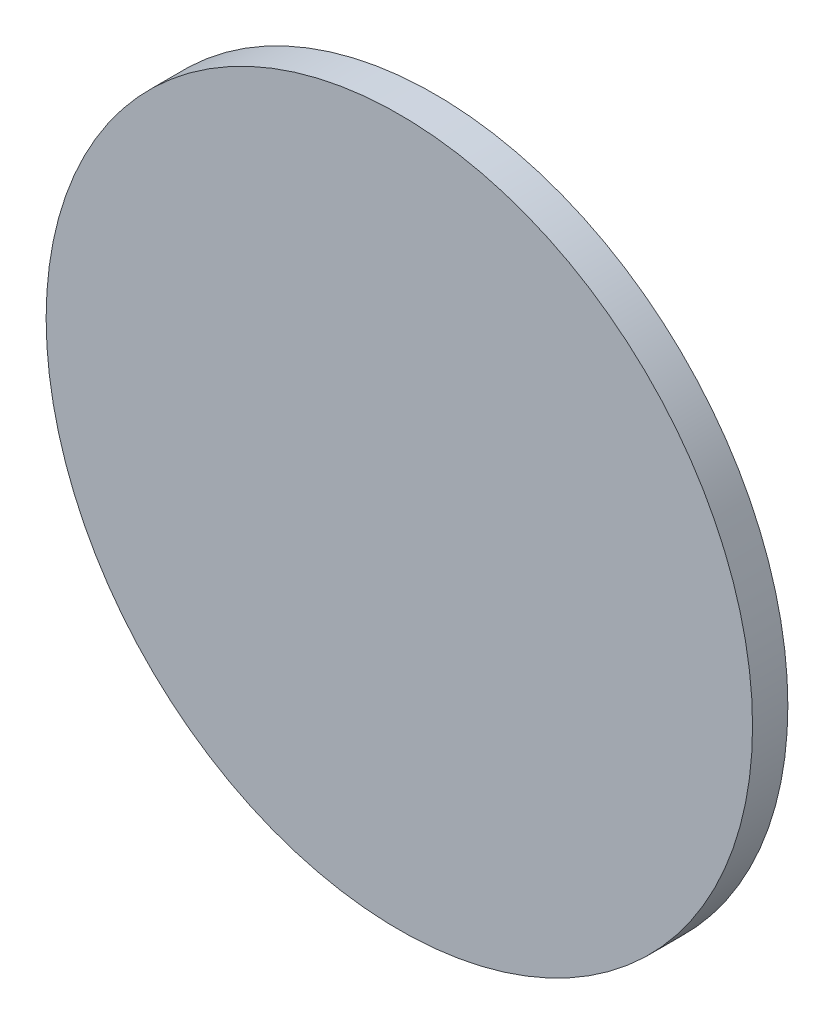
ISO-10303-21;
HEADER;
FILE_DESCRIPTION(('STEP AP214'),'2;1');
FILE_NAME('part.step','',(''),(''),'','','');
FILE_SCHEMA(('AUTOMOTIVE_DESIGN { 1 0 10303 214 1 1 1 1 }'));
ENDSEC;
DATA;
#1=APPLICATION_CONTEXT('core data for automotive mechanical design processes');
#2=APPLICATION_PROTOCOL_DEFINITION('international standard','automotive_design',2000,#1);
#3=PRODUCT_CONTEXT('',#1,'mechanical');
#4=PRODUCT('Part','Part','',(#3));
#5=PRODUCT_RELATED_PRODUCT_CATEGORY('part','',(#4));
#6=PRODUCT_DEFINITION_FORMATION('','',#4);
#7=PRODUCT_DEFINITION_CONTEXT('part definition',#1,'design');
#8=PRODUCT_DEFINITION('design','',#6,#7);
#9=PRODUCT_DEFINITION_SHAPE('','',#8);
#10=(LENGTH_UNIT() NAMED_UNIT(*) SI_UNIT(.MILLI.,.METRE.));
#11=(NAMED_UNIT(*) PLANE_ANGLE_UNIT() SI_UNIT($,.RADIAN.));
#12=(NAMED_UNIT(*) SI_UNIT($,.STERADIAN.) SOLID_ANGLE_UNIT());
#13=UNCERTAINTY_MEASURE_WITH_UNIT(LENGTH_MEASURE(1.E-05),#10,'distance_accuracy_value','');
#14=(GEOMETRIC_REPRESENTATION_CONTEXT(3) GLOBAL_UNCERTAINTY_ASSIGNED_CONTEXT((#13)) GLOBAL_UNIT_ASSIGNED_CONTEXT((#10,
#11,#12)) REPRESENTATION_CONTEXT('',''));
#15=CARTESIAN_POINT('',(0.,0.,0.));
#16=DIRECTION('',(0.,0.,1.));
#17=DIRECTION('',(1.,0.,0.));
#18=AXIS2_PLACEMENT_3D('',#15,#16,#17);
#19=CARTESIAN_POINT('',(0.0999998,0.,0.00999998));
#20=DIRECTION('',(0.,0.,-1.));
#21=DIRECTION('',(0.,-1.,0.));
#22=AXIS2_PLACEMENT_3D('',#19,#20,#21);
#23=PLANE('',#22);
#24=CARTESIAN_POINT('',(0.,0.,0.00999998));
#25=DIRECTION('',(0.,0.,1.));
#26=DIRECTION('',(1.,0.,0.));
#27=AXIS2_PLACEMENT_3D('',#24,#25,#26);
#28=CIRCLE('',#27,0.0999998);
#29=CARTESIAN_POINT('',(0.0999998,0.,0.00999998));
#30=VERTEX_POINT('',#29);
#31=EDGE_CURVE('E11',#30,#30,#28,.T.);
#32=ORIENTED_EDGE('',*,*,#31,.T.);
#33=EDGE_LOOP('',(#32));
#34=FACE_BOUND('',#33,.T.);
#35=ADVANCED_FACE('F16',(#34),#23,.F.);
#36=CARTESIAN_POINT('',(0.0999998,0.,0.));
#37=DIRECTION('',(0.,0.,-1.));
#38=DIRECTION('',(0.,-1.,0.));
#39=AXIS2_PLACEMENT_3D('',#36,#37,#38);
#40=PLANE('',#39);
#41=CARTESIAN_POINT('',(0.,0.,0.));
#42=DIRECTION('',(0.,0.,1.));
#43=DIRECTION('',(1.,0.,0.));
#44=AXIS2_PLACEMENT_3D('',#41,#42,#43);
#45=CIRCLE('',#44,0.0999998);
#46=CARTESIAN_POINT('',(0.0999998,0.,0.));
#47=VERTEX_POINT('',#46);
#48=EDGE_CURVE('E42',#47,#47,#45,.T.);
#49=ORIENTED_EDGE('',*,*,#48,.F.);
#50=EDGE_LOOP('',(#49));
#51=FACE_BOUND('',#50,.T.);
#52=ADVANCED_FACE('F55',(#51),#40,.T.);
#53=CARTESIAN_POINT('',(0.,0.,0.));
#54=DIRECTION('',(0.,0.,-1.));
#55=DIRECTION('',(1.,0.,0.));
#56=AXIS2_PLACEMENT_3D('',#53,#54,#55);
#57=CYLINDRICAL_SURFACE('',#56,0.0999998);
#58=ORIENTED_EDGE('',*,*,#48,.T.);
#59=DIRECTION('',(0.,0.,1.));
#60=VECTOR('',#59,1.);
#61=CARTESIAN_POINT('',(0.0999998,0.,0.));
#62=LINE('',#61,#60);
#63=EDGE_CURVE('E19',#47,#30,#62,.T.);
#64=ORIENTED_EDGE('',*,*,#63,.T.);
#65=ORIENTED_EDGE('',*,*,#31,.F.);
#66=ORIENTED_EDGE('',*,*,#63,.F.);
#67=EDGE_LOOP('',(#58,#64,#65,#66));
#68=FACE_BOUND('',#67,.T.);
#69=ADVANCED_FACE('F40',(#68),#57,.T.);
#70=CLOSED_SHELL('',(#35,#52,#69));
#71=MANIFOLD_SOLID_BREP('B1',#70);
#72=ADVANCED_BREP_SHAPE_REPRESENTATION('',(#18,#71),#14);
#73=SHAPE_DEFINITION_REPRESENTATION(#9,#72);
ENDSEC;
END-ISO-10303-21;
